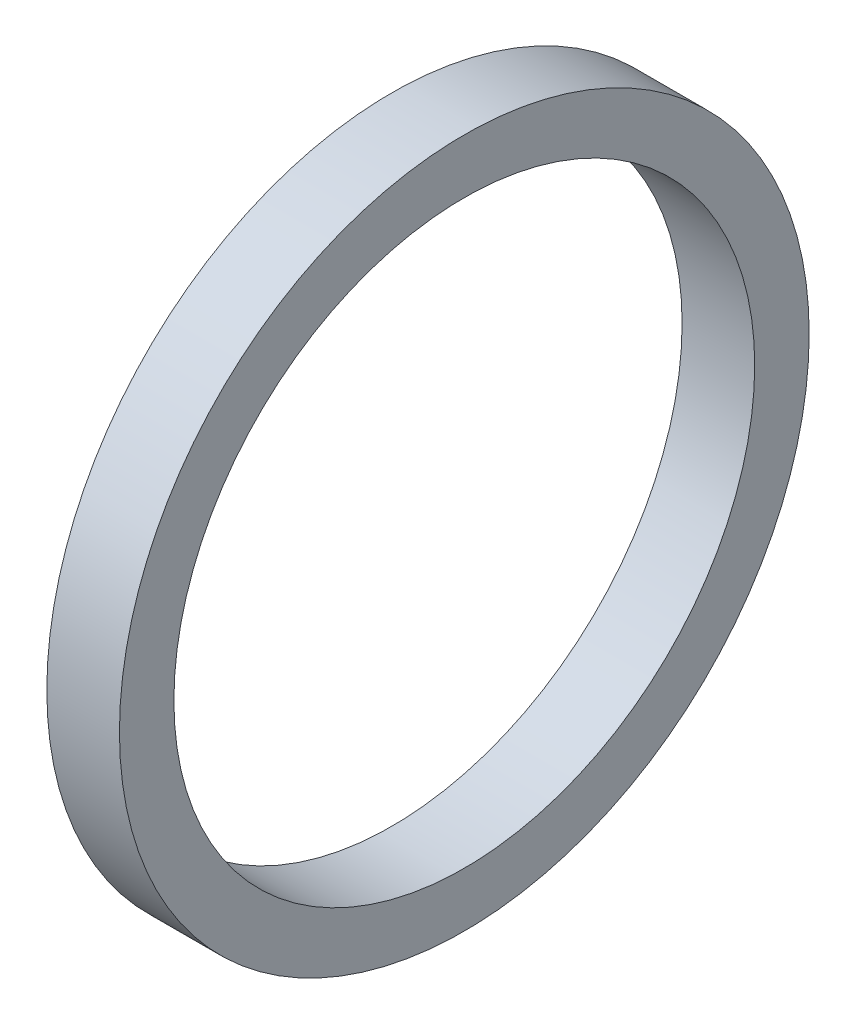
ISO-10303-21;
HEADER;
FILE_DESCRIPTION(('STEP AP214'),'2;1');
FILE_NAME('part.step','',(''),(''),'','','');
FILE_SCHEMA(('AUTOMOTIVE_DESIGN { 1 0 10303 214 1 1 1 1 }'));
ENDSEC;
DATA;
#1=APPLICATION_CONTEXT('core data for automotive mechanical design processes');
#2=APPLICATION_PROTOCOL_DEFINITION('international standard','automotive_design',2000,#1);
#3=PRODUCT_CONTEXT('',#1,'mechanical');
#4=PRODUCT('Part','Part','',(#3));
#5=PRODUCT_RELATED_PRODUCT_CATEGORY('part','',(#4));
#6=PRODUCT_DEFINITION_FORMATION('','',#4);
#7=PRODUCT_DEFINITION_CONTEXT('part definition',#1,'design');
#8=PRODUCT_DEFINITION('design','',#6,#7);
#9=PRODUCT_DEFINITION_SHAPE('','',#8);
#10=(LENGTH_UNIT() NAMED_UNIT(*) SI_UNIT(.MILLI.,.METRE.));
#11=(NAMED_UNIT(*) PLANE_ANGLE_UNIT() SI_UNIT($,.RADIAN.));
#12=(NAMED_UNIT(*) SI_UNIT($,.STERADIAN.) SOLID_ANGLE_UNIT());
#13=UNCERTAINTY_MEASURE_WITH_UNIT(LENGTH_MEASURE(1.E-05),#10,'distance_accuracy_value','');
#14=(GEOMETRIC_REPRESENTATION_CONTEXT(3) GLOBAL_UNCERTAINTY_ASSIGNED_CONTEXT((#13)) GLOBAL_UNIT_ASSIGNED_CONTEXT((#10,
#11,#12)) REPRESENTATION_CONTEXT('',''));
#15=CARTESIAN_POINT('',(0.,0.,0.));
#16=DIRECTION('',(0.,0.,1.));
#17=DIRECTION('',(1.,0.,0.));
#18=AXIS2_PLACEMENT_3D('',#15,#16,#17);
#19=CARTESIAN_POINT('',(4152.91323559405,-912.609630618239,4939.61346244186));
#20=DIRECTION('',(-1.,0.,0.));
#21=DIRECTION('',(0.,0.,1.));
#22=AXIS2_PLACEMENT_3D('',#19,#20,#21);
#23=PLANE('',#22);
#24=CARTESIAN_POINT('',(4152.91323559405,-912.557445344976,4955.61337733842));
#25=DIRECTION('',(-1.,0.,0.));
#26=DIRECTION('',(0.,0.,1.));
#27=AXIS2_PLACEMENT_3D('',#24,#25,#26);
#28=CIRCLE('',#27,19.0000000000001);
#29=CARTESIAN_POINT('',(4152.91323559405,-912.557445344976,4974.61337733842));
#30=VERTEX_POINT('',#29);
#31=EDGE_CURVE('E10',#30,#30,#28,.T.);
#32=ORIENTED_EDGE('',*,*,#31,.F.);
#33=EDGE_LOOP('',(#32));
#34=FACE_BOUND('',#33,.T.);
#35=CARTESIAN_POINT('',(4152.91323559405,-912.557445344976,4955.61337733842));
#36=DIRECTION('',(-1.,0.,0.));
#37=DIRECTION('',(0.,0.,1.));
#38=AXIS2_PLACEMENT_3D('',#35,#36,#37);
#39=CIRCLE('',#38,16.);
#40=CARTESIAN_POINT('',(4152.91323559405,-912.557445344976,4971.61337733842));
#41=VERTEX_POINT('',#40);
#42=EDGE_CURVE('E46',#41,#41,#39,.T.);
#43=ORIENTED_EDGE('',*,*,#42,.T.);
#44=EDGE_LOOP('',(#43));
#45=FACE_BOUND('',#44,.T.);
#46=ADVANCED_FACE('F32',(#34,#45),#23,.F.);
#47=CARTESIAN_POINT('',(4131.91323559405,-912.557445344976,4955.61337733842));
#48=DIRECTION('',(-1.,0.,0.));
#49=DIRECTION('',(0.,0.,1.));
#50=AXIS2_PLACEMENT_3D('',#47,#48,#49);
#51=CYLINDRICAL_SURFACE('',#50,19.0000000000001);
#52=CARTESIAN_POINT('',(4148.91323559405,-912.557445344976,4955.61337733842));
#53=DIRECTION('',(-1.,0.,0.));
#54=DIRECTION('',(0.,0.,1.));
#55=AXIS2_PLACEMENT_3D('',#52,#53,#54);
#56=CIRCLE('',#55,19.0000000000001);
#57=CARTESIAN_POINT('',(4148.91323559405,-912.557445344976,4974.61337733842));
#58=VERTEX_POINT('',#57);
#59=EDGE_CURVE('E38',#58,#58,#56,.T.);
#60=ORIENTED_EDGE('',*,*,#59,.F.);
#61=EDGE_LOOP('',(#60));
#62=FACE_BOUND('',#61,.T.);
#63=ORIENTED_EDGE('',*,*,#31,.T.);
#64=EDGE_LOOP('',(#63));
#65=FACE_BOUND('',#64,.T.);
#66=ADVANCED_FACE('F61',(#62,#65),#51,.T.);
#67=CARTESIAN_POINT('',(4148.91323559405,-912.609630618239,4939.61346244186));
#68=DIRECTION('',(1.,0.,0.));
#69=DIRECTION('',(0.,0.,-1.));
#70=AXIS2_PLACEMENT_3D('',#67,#68,#69);
#71=PLANE('',#70);
#72=CARTESIAN_POINT('',(4148.91323559405,-912.557445344976,4955.61337733842));
#73=DIRECTION('',(-1.,0.,0.));
#74=DIRECTION('',(0.,0.,1.));
#75=AXIS2_PLACEMENT_3D('',#72,#73,#74);
#76=CIRCLE('',#75,16.);
#77=CARTESIAN_POINT('',(4148.91323559405,-912.557445344976,4971.61337733842));
#78=VERTEX_POINT('',#77);
#79=EDGE_CURVE('E42',#78,#78,#76,.T.);
#80=ORIENTED_EDGE('',*,*,#79,.F.);
#81=EDGE_LOOP('',(#80));
#82=FACE_BOUND('',#81,.T.);
#83=ORIENTED_EDGE('',*,*,#59,.T.);
#84=EDGE_LOOP('',(#83));
#85=FACE_BOUND('',#84,.T.);
#86=ADVANCED_FACE('F56',(#82,#85),#71,.F.);
#87=CARTESIAN_POINT('',(4131.91323559405,-912.557445344976,4955.61337733842));
#88=DIRECTION('',(-1.,0.,0.));
#89=DIRECTION('',(0.,0.,1.));
#90=AXIS2_PLACEMENT_3D('',#87,#88,#89);
#91=CYLINDRICAL_SURFACE('',#90,16.);
#92=ORIENTED_EDGE('',*,*,#42,.F.);
#93=EDGE_LOOP('',(#92));
#94=FACE_BOUND('',#93,.T.);
#95=ORIENTED_EDGE('',*,*,#79,.T.);
#96=EDGE_LOOP('',(#95));
#97=FACE_BOUND('',#96,.T.);
#98=ADVANCED_FACE('F53',(#94,#97),#91,.F.);
#99=CLOSED_SHELL('',(#46,#66,#86,#98));
#100=MANIFOLD_SOLID_BREP('B2',#99);
#101=ADVANCED_BREP_SHAPE_REPRESENTATION('',(#18,#100),#14);
#102=SHAPE_DEFINITION_REPRESENTATION(#9,#101);
ENDSEC;
END-ISO-10303-21;
